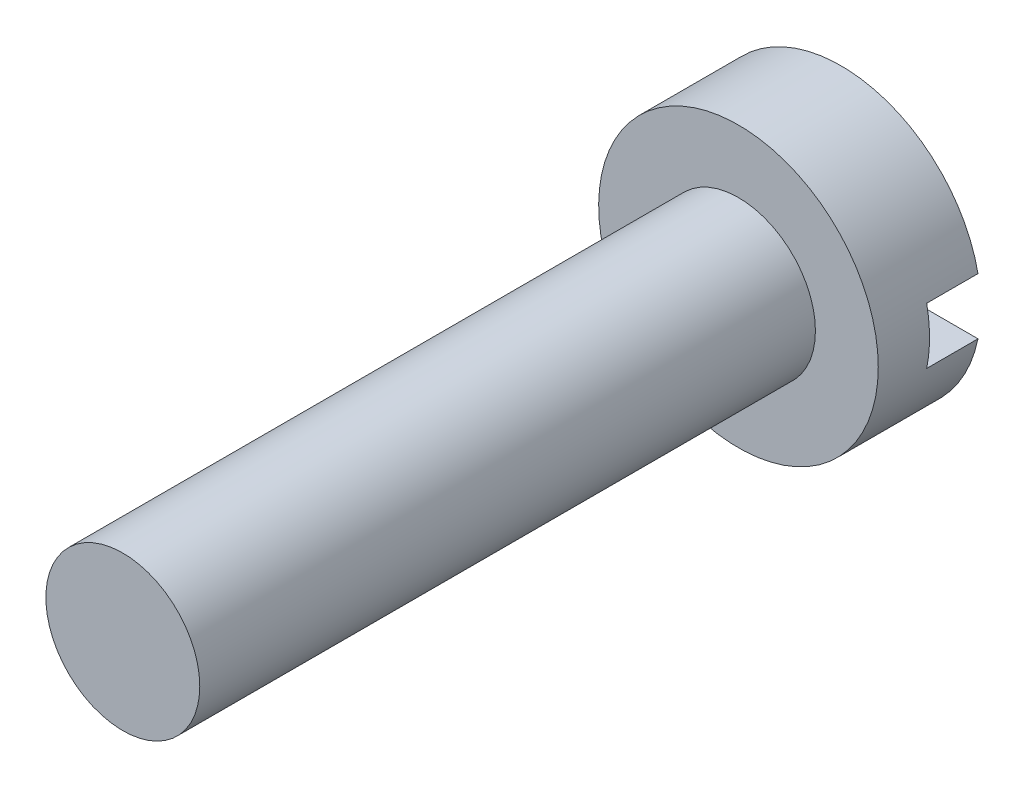
ISO-10303-21;
HEADER;
FILE_DESCRIPTION(('STEP AP214'),'2;1');
FILE_NAME('part.step','',(''),(''),'','','');
FILE_SCHEMA(('AUTOMOTIVE_DESIGN { 1 0 10303 214 1 1 1 1 }'));
ENDSEC;
DATA;
#1=APPLICATION_CONTEXT('core data for automotive mechanical design processes');
#2=APPLICATION_PROTOCOL_DEFINITION('international standard','automotive_design',2000,#1);
#3=PRODUCT_CONTEXT('',#1,'mechanical');
#4=PRODUCT('Part','Part','',(#3));
#5=PRODUCT_RELATED_PRODUCT_CATEGORY('part','',(#4));
#6=PRODUCT_DEFINITION_FORMATION('','',#4);
#7=PRODUCT_DEFINITION_CONTEXT('part definition',#1,'design');
#8=PRODUCT_DEFINITION('design','',#6,#7);
#9=PRODUCT_DEFINITION_SHAPE('','',#8);
#10=(LENGTH_UNIT() NAMED_UNIT(*) SI_UNIT(.MILLI.,.METRE.));
#11=(NAMED_UNIT(*) PLANE_ANGLE_UNIT() SI_UNIT($,.RADIAN.));
#12=(NAMED_UNIT(*) SI_UNIT($,.STERADIAN.) SOLID_ANGLE_UNIT());
#13=UNCERTAINTY_MEASURE_WITH_UNIT(LENGTH_MEASURE(1.E-05),#10,'distance_accuracy_value','');
#14=(GEOMETRIC_REPRESENTATION_CONTEXT(3) GLOBAL_UNCERTAINTY_ASSIGNED_CONTEXT((#13)) GLOBAL_UNIT_ASSIGNED_CONTEXT((#10,
#11,#12)) REPRESENTATION_CONTEXT('',''));
#15=CARTESIAN_POINT('',(0.,0.,0.));
#16=DIRECTION('',(0.,0.,1.));
#17=DIRECTION('',(1.,0.,0.));
#18=AXIS2_PLACEMENT_3D('',#15,#16,#17);
#19=CARTESIAN_POINT('',(0.,0.,2.));
#20=DIRECTION('',(0.,0.,1.));
#21=DIRECTION('',(1.,0.,0.));
#22=AXIS2_PLACEMENT_3D('',#19,#20,#21);
#23=PLANE('',#22);
#24=CARTESIAN_POINT('',(0.,0.,2.));
#25=DIRECTION('',(0.,0.,1.));
#26=DIRECTION('',(1.,0.,0.));
#27=AXIS2_PLACEMENT_3D('',#24,#25,#26);
#28=CIRCLE('',#27,2.725);
#29=CARTESIAN_POINT('',(2.725,0.,2.));
#30=VERTEX_POINT('',#29);
#31=EDGE_CURVE('E80',#30,#30,#28,.T.);
#32=ORIENTED_EDGE('',*,*,#31,.T.);
#33=EDGE_LOOP('',(#32));
#34=FACE_BOUND('',#33,.T.);
#35=CARTESIAN_POINT('',(0.,0.,2.));
#36=DIRECTION('',(0.,0.,1.));
#37=DIRECTION('',(1.,0.,0.));
#38=AXIS2_PLACEMENT_3D('',#35,#36,#37);
#39=CIRCLE('',#38,1.5);
#40=CARTESIAN_POINT('',(1.5,0.,2.));
#41=VERTEX_POINT('',#40);
#42=EDGE_CURVE('E146',#41,#41,#39,.T.);
#43=ORIENTED_EDGE('',*,*,#42,.F.);
#44=EDGE_LOOP('',(#43));
#45=FACE_BOUND('',#44,.T.);
#46=ADVANCED_FACE('F32',(#34,#45),#23,.T.);
#47=CARTESIAN_POINT('',(0.,0.,0.));
#48=DIRECTION('',(0.,0.,1.));
#49=DIRECTION('',(1.,0.,0.));
#50=AXIS2_PLACEMENT_3D('',#47,#48,#49);
#51=PLANE('',#50);
#52=CARTESIAN_POINT('',(0.,0.,0.));
#53=DIRECTION('',(0.,0.,1.));
#54=DIRECTION('',(1.,0.,0.));
#55=AXIS2_PLACEMENT_3D('',#52,#53,#54);
#56=CIRCLE('',#55,2.725);
#57=CARTESIAN_POINT('',(-2.66891832021889,-0.55,0.));
#58=VERTEX_POINT('',#57);
#59=CARTESIAN_POINT('',(2.66891832021889,-0.55,0.));
#60=VERTEX_POINT('',#59);
#61=EDGE_CURVE('E91',#58,#60,#56,.T.);
#62=ORIENTED_EDGE('',*,*,#61,.F.);
#63=DIRECTION('',(1.,0.,0.));
#64=VECTOR('',#63,1.);
#65=CARTESIAN_POINT('',(0.,-0.55,0.));
#66=LINE('',#65,#64);
#67=EDGE_CURVE('E79',#58,#60,#66,.T.);
#68=ORIENTED_EDGE('',*,*,#67,.T.);
#69=EDGE_LOOP('',(#62,#68));
#70=FACE_BOUND('',#69,.T.);
#71=ADVANCED_FACE('F109',(#70),#51,.F.);
#72=CARTESIAN_POINT('',(0.,0.,2.));
#73=DIRECTION('',(0.,0.,-1.));
#74=DIRECTION('',(-1.,0.,0.));
#75=AXIS2_PLACEMENT_3D('',#72,#73,#74);
#76=CYLINDRICAL_SURFACE('',#75,2.725);
#77=ORIENTED_EDGE('',*,*,#61,.T.);
#78=DIRECTION('',(0.,0.,-1.));
#79=VECTOR('',#78,1.);
#80=CARTESIAN_POINT('',(2.66891832021889,-0.55,2.));
#81=LINE('',#80,#79);
#82=CARTESIAN_POINT('',(2.66891832021889,-0.55,1.));
#83=VERTEX_POINT('',#82);
#84=EDGE_CURVE('E88',#60,#83,#81,.F.);
#85=ORIENTED_EDGE('',*,*,#84,.T.);
#86=CARTESIAN_POINT('',(0.,0.,1.));
#87=DIRECTION('',(0.,0.,-1.));
#88=DIRECTION('',(-1.,0.,0.));
#89=AXIS2_PLACEMENT_3D('',#86,#87,#88);
#90=CIRCLE('',#89,2.725);
#91=CARTESIAN_POINT('',(2.66891832021889,0.55,1.));
#92=VERTEX_POINT('',#91);
#93=EDGE_CURVE('E11',#92,#83,#90,.T.);
#94=ORIENTED_EDGE('',*,*,#93,.F.);
#95=DIRECTION('',(0.,0.,-1.));
#96=VECTOR('',#95,1.);
#97=CARTESIAN_POINT('',(2.66891832021889,0.55,2.));
#98=LINE('',#97,#96);
#99=CARTESIAN_POINT('',(2.66891832021889,0.55,0.));
#100=VERTEX_POINT('',#99);
#101=EDGE_CURVE('E74',#92,#100,#98,.T.);
#102=ORIENTED_EDGE('',*,*,#101,.T.);
#103=CARTESIAN_POINT('',(-2.66891832021889,0.55,0.));
#104=VERTEX_POINT('',#103);
#105=EDGE_CURVE('E86',#100,#104,#56,.T.);
#106=ORIENTED_EDGE('',*,*,#105,.T.);
#107=DIRECTION('',(0.,0.,-1.));
#108=VECTOR('',#107,1.);
#109=CARTESIAN_POINT('',(-2.66891832021889,0.55,2.));
#110=LINE('',#109,#108);
#111=CARTESIAN_POINT('',(-2.66891832021889,0.55,1.));
#112=VERTEX_POINT('',#111);
#113=EDGE_CURVE('E47',#104,#112,#110,.F.);
#114=ORIENTED_EDGE('',*,*,#113,.T.);
#115=CARTESIAN_POINT('',(-2.66891832021889,-0.55,1.));
#116=VERTEX_POINT('',#115);
#117=EDGE_CURVE('E36',#116,#112,#90,.T.);
#118=ORIENTED_EDGE('',*,*,#117,.F.);
#119=DIRECTION('',(0.,0.,-1.));
#120=VECTOR('',#119,1.);
#121=CARTESIAN_POINT('',(-2.66891832021889,-0.55,2.));
#122=LINE('',#121,#120);
#123=EDGE_CURVE('E55',#116,#58,#122,.T.);
#124=ORIENTED_EDGE('',*,*,#123,.T.);
#125=EDGE_LOOP('',(#77,#85,#94,#102,#106,#114,#118,#124));
#126=FACE_BOUND('',#125,.T.);
#127=ORIENTED_EDGE('',*,*,#31,.F.);
#128=EDGE_LOOP('',(#127));
#129=FACE_BOUND('',#128,.T.);
#130=ADVANCED_FACE('F34',(#126,#129),#76,.T.);
#131=ORIENTED_EDGE('',*,*,#105,.F.);
#132=DIRECTION('',(-1.,0.,0.));
#133=VECTOR('',#132,1.);
#134=CARTESIAN_POINT('',(0.,0.55,0.));
#135=LINE('',#134,#133);
#136=EDGE_CURVE('E71',#100,#104,#135,.T.);
#137=ORIENTED_EDGE('',*,*,#136,.T.);
#138=EDGE_LOOP('',(#131,#137));
#139=FACE_BOUND('',#138,.T.);
#140=ADVANCED_FACE('F90',(#139),#51,.F.);
#141=CARTESIAN_POINT('',(-3.44980190887808,0.55,1.));
#142=DIRECTION('',(0.,0.,-1.));
#143=DIRECTION('',(-1.,0.,0.));
#144=AXIS2_PLACEMENT_3D('',#141,#142,#143);
#145=PLANE('',#144);
#146=ORIENTED_EDGE('',*,*,#93,.T.);
#147=DIRECTION('',(-1.,0.,0.));
#148=VECTOR('',#147,1.);
#149=CARTESIAN_POINT('',(3.90126958400864,-0.55,1.));
#150=LINE('',#149,#148);
#151=EDGE_CURVE('E104',#83,#116,#150,.T.);
#152=ORIENTED_EDGE('',*,*,#151,.T.);
#153=ORIENTED_EDGE('',*,*,#117,.T.);
#154=DIRECTION('',(1.,0.,0.));
#155=VECTOR('',#154,1.);
#156=CARTESIAN_POINT('',(-3.44980190887808,0.55,1.));
#157=LINE('',#156,#155);
#158=EDGE_CURVE('E103',#112,#92,#157,.T.);
#159=ORIENTED_EDGE('',*,*,#158,.T.);
#160=EDGE_LOOP('',(#146,#152,#153,#159));
#161=FACE_BOUND('',#160,.T.);
#162=ADVANCED_FACE('F102',(#161),#145,.T.);
#163=CARTESIAN_POINT('',(3.90126958400864,-0.55,1.));
#164=DIRECTION('',(0.,-1.,0.));
#165=DIRECTION('',(0.,0.,-1.));
#166=AXIS2_PLACEMENT_3D('',#163,#164,#165);
#167=PLANE('',#166);
#168=ORIENTED_EDGE('',*,*,#151,.F.);
#169=ORIENTED_EDGE('',*,*,#84,.F.);
#170=ORIENTED_EDGE('',*,*,#67,.F.);
#171=ORIENTED_EDGE('',*,*,#123,.F.);
#172=EDGE_LOOP('',(#168,#169,#170,#171));
#173=FACE_BOUND('',#172,.T.);
#174=ADVANCED_FACE('F122',(#173),#167,.F.);
#175=CARTESIAN_POINT('',(-3.44980190887808,0.55,1.));
#176=DIRECTION('',(0.,1.,0.));
#177=DIRECTION('',(0.,0.,1.));
#178=AXIS2_PLACEMENT_3D('',#175,#176,#177);
#179=PLANE('',#178);
#180=ORIENTED_EDGE('',*,*,#158,.F.);
#181=ORIENTED_EDGE('',*,*,#113,.F.);
#182=ORIENTED_EDGE('',*,*,#136,.F.);
#183=ORIENTED_EDGE('',*,*,#101,.F.);
#184=EDGE_LOOP('',(#180,#181,#182,#183));
#185=FACE_BOUND('',#184,.T.);
#186=ADVANCED_FACE('F73',(#185),#179,.F.);
#187=CARTESIAN_POINT('',(0.,0.,14.));
#188=DIRECTION('',(0.,0.,-1.));
#189=DIRECTION('',(-1.,0.,0.));
#190=AXIS2_PLACEMENT_3D('',#187,#188,#189);
#191=CYLINDRICAL_SURFACE('',#190,1.5);
#192=CARTESIAN_POINT('',(0.,0.,14.));
#193=DIRECTION('',(0.,0.,1.));
#194=DIRECTION('',(1.,0.,0.));
#195=AXIS2_PLACEMENT_3D('',#192,#193,#194);
#196=CIRCLE('',#195,1.5);
#197=CARTESIAN_POINT('',(1.5,0.,14.));
#198=VERTEX_POINT('',#197);
#199=EDGE_CURVE('E105',#198,#198,#196,.T.);
#200=ORIENTED_EDGE('',*,*,#199,.F.);
#201=EDGE_LOOP('',(#200));
#202=FACE_BOUND('',#201,.T.);
#203=ORIENTED_EDGE('',*,*,#42,.T.);
#204=EDGE_LOOP('',(#203));
#205=FACE_BOUND('',#204,.T.);
#206=ADVANCED_FACE('F129',(#202,#205),#191,.T.);
#207=CARTESIAN_POINT('',(0.,0.,14.));
#208=DIRECTION('',(0.,0.,1.));
#209=DIRECTION('',(1.,0.,0.));
#210=AXIS2_PLACEMENT_3D('',#207,#208,#209);
#211=PLANE('',#210);
#212=ORIENTED_EDGE('',*,*,#199,.T.);
#213=EDGE_LOOP('',(#212));
#214=FACE_BOUND('',#213,.T.);
#215=ADVANCED_FACE('F135',(#214),#211,.T.);
#216=CLOSED_SHELL('',(#46,#71,#130,#140,#162,#174,#186,#206,#215));
#217=MANIFOLD_SOLID_BREP('B2',#216);
#218=ADVANCED_BREP_SHAPE_REPRESENTATION('',(#18,#217),#14);
#219=SHAPE_DEFINITION_REPRESENTATION(#9,#218);
ENDSEC;
END-ISO-10303-21;
